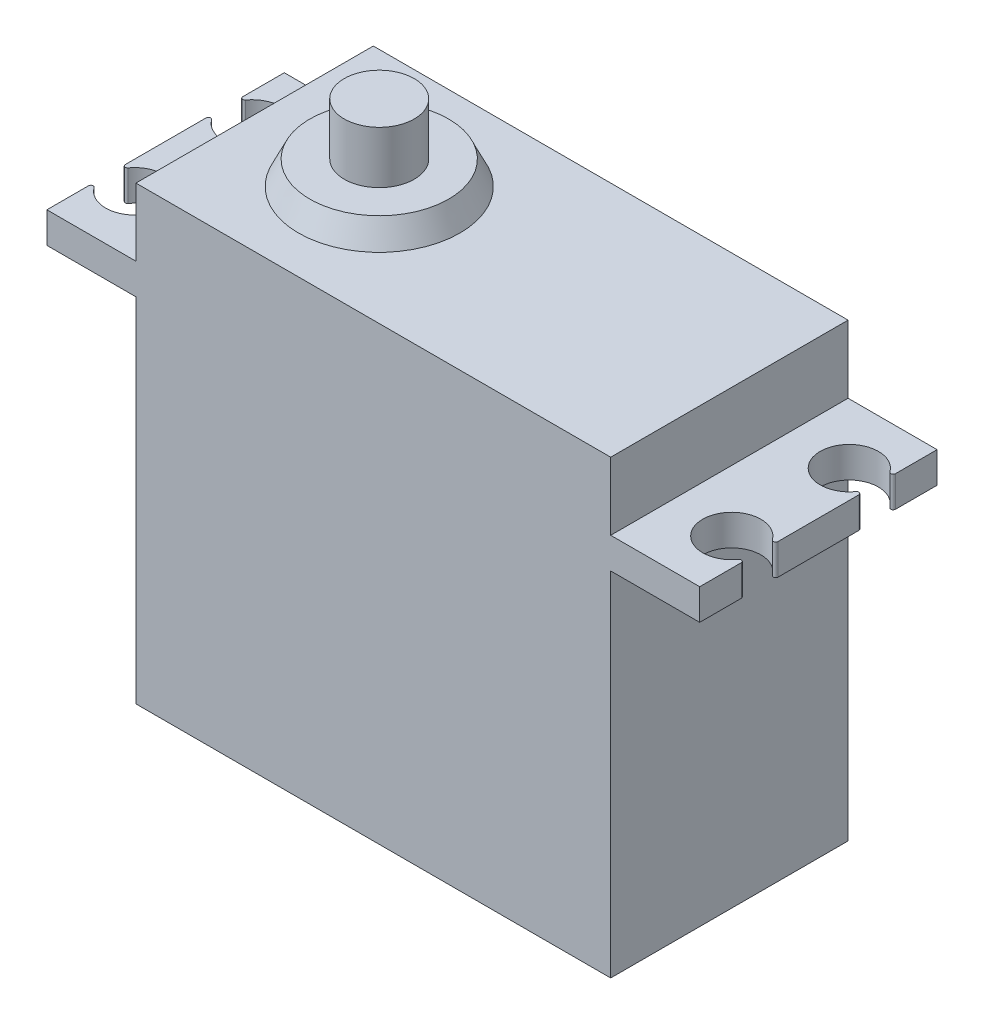
ISO-10303-21;
HEADER;
FILE_DESCRIPTION(('STEP AP214'),'2;1');
FILE_NAME('part.step','',(''),(''),'','','');
FILE_SCHEMA(('AUTOMOTIVE_DESIGN { 1 0 10303 214 1 1 1 1 }'));
ENDSEC;
DATA;
#1=APPLICATION_CONTEXT('core data for automotive mechanical design processes');
#2=APPLICATION_PROTOCOL_DEFINITION('international standard','automotive_design',2000,#1);
#3=PRODUCT_CONTEXT('',#1,'mechanical');
#4=PRODUCT('Part','Part','',(#3));
#5=PRODUCT_RELATED_PRODUCT_CATEGORY('part','',(#4));
#6=PRODUCT_DEFINITION_FORMATION('','',#4);
#7=PRODUCT_DEFINITION_CONTEXT('part definition',#1,'design');
#8=PRODUCT_DEFINITION('design','',#6,#7);
#9=PRODUCT_DEFINITION_SHAPE('','',#8);
#10=(LENGTH_UNIT() NAMED_UNIT(*) SI_UNIT(.MILLI.,.METRE.));
#11=(NAMED_UNIT(*) PLANE_ANGLE_UNIT() SI_UNIT($,.RADIAN.));
#12=(NAMED_UNIT(*) SI_UNIT($,.STERADIAN.) SOLID_ANGLE_UNIT());
#13=UNCERTAINTY_MEASURE_WITH_UNIT(LENGTH_MEASURE(1.E-05),#10,'distance_accuracy_value','');
#14=(GEOMETRIC_REPRESENTATION_CONTEXT(3) GLOBAL_UNCERTAINTY_ASSIGNED_CONTEXT((#13)) GLOBAL_UNIT_ASSIGNED_CONTEXT((#10,
#11,#12)) REPRESENTATION_CONTEXT('',''));
#15=CARTESIAN_POINT('',(0.,0.,0.));
#16=DIRECTION('',(0.,0.,1.));
#17=DIRECTION('',(1.,0.,0.));
#18=AXIS2_PLACEMENT_3D('',#15,#16,#17);
#19=CARTESIAN_POINT('',(-18.,0.,10.));
#20=DIRECTION('',(-1.,0.,0.));
#21=DIRECTION('',(0.,0.,1.));
#22=AXIS2_PLACEMENT_3D('',#19,#20,#21);
#23=PLANE('',#22);
#24=DIRECTION('',(0.,0.,-1.));
#25=VECTOR('',#24,1.);
#26=CARTESIAN_POINT('',(-18.,-5.70000000000001,10.));
#27=LINE('',#26,#25);
#28=CARTESIAN_POINT('',(-18.,-5.70000000000001,10.));
#29=VERTEX_POINT('',#28);
#30=CARTESIAN_POINT('',(-18.,-5.70000000000001,6.49919333848294));
#31=VERTEX_POINT('',#30);
#32=EDGE_CURVE('E327',#29,#31,#27,.T.);
#33=ORIENTED_EDGE('',*,*,#32,.T.);
#34=DIRECTION('',(0.,-1.,0.));
#35=VECTOR('',#34,1.);
#36=CARTESIAN_POINT('',(-18.,-8.30000000000001,6.49919333848294));
#37=LINE('',#36,#35);
#38=CARTESIAN_POINT('',(-18.,-8.30000000000001,6.49919333848294));
#39=VERTEX_POINT('',#38);
#40=EDGE_CURVE('E406',#31,#39,#37,.T.);
#41=ORIENTED_EDGE('',*,*,#40,.T.);
#42=DIRECTION('',(0.,0.,-1.));
#43=VECTOR('',#42,1.);
#44=CARTESIAN_POINT('',(-18.,-8.30000000000001,10.));
#45=LINE('',#44,#43);
#46=CARTESIAN_POINT('',(-18.,-8.30000000000001,10.));
#47=VERTEX_POINT('',#46);
#48=EDGE_CURVE('E322',#47,#39,#45,.T.);
#49=ORIENTED_EDGE('',*,*,#48,.F.);
#50=DIRECTION('',(0.,1.,0.));
#51=VECTOR('',#50,1.);
#52=CARTESIAN_POINT('',(-18.,0.,10.));
#53=LINE('',#52,#51);
#54=EDGE_CURVE('E259',#47,#29,#53,.T.);
#55=ORIENTED_EDGE('',*,*,#54,.T.);
#56=EDGE_LOOP('',(#33,#41,#49,#55));
#57=FACE_BOUND('',#56,.T.);
#58=ADVANCED_FACE('F39',(#57),#23,.T.);
#59=CARTESIAN_POINT('',(-18.,-8.30000000000001,3.40080666151706));
#60=VERTEX_POINT('',#59);
#61=CARTESIAN_POINT('',(-18.,-8.30000000000001,-3.40080666151706));
#62=VERTEX_POINT('',#61);
#63=EDGE_CURVE('E326',#60,#62,#45,.T.);
#64=ORIENTED_EDGE('',*,*,#63,.F.);
#65=DIRECTION('',(0.,-1.,0.));
#66=VECTOR('',#65,1.);
#67=CARTESIAN_POINT('',(-18.,-5.7,3.40080666151706));
#68=LINE('',#67,#66);
#69=CARTESIAN_POINT('',(-18.,-5.70000000000001,3.40080666151706));
#70=VERTEX_POINT('',#69);
#71=EDGE_CURVE('E398',#60,#70,#68,.F.);
#72=ORIENTED_EDGE('',*,*,#71,.T.);
#73=CARTESIAN_POINT('',(-18.,-5.70000000000001,-3.40080666151706));
#74=VERTEX_POINT('',#73);
#75=EDGE_CURVE('E331',#70,#74,#27,.T.);
#76=ORIENTED_EDGE('',*,*,#75,.T.);
#77=DIRECTION('',(0.,-1.,0.));
#78=VECTOR('',#77,1.);
#79=CARTESIAN_POINT('',(-18.,-8.30000000000001,-3.40080666151706));
#80=LINE('',#79,#78);
#81=EDGE_CURVE('E396',#74,#62,#80,.T.);
#82=ORIENTED_EDGE('',*,*,#81,.T.);
#83=EDGE_LOOP('',(#64,#72,#76,#82));
#84=FACE_BOUND('',#83,.T.);
#85=ADVANCED_FACE('F457',(#84),#23,.T.);
#86=CARTESIAN_POINT('',(37.,0.,10.));
#87=DIRECTION('',(-1.,0.,0.));
#88=DIRECTION('',(0.,0.,1.));
#89=AXIS2_PLACEMENT_3D('',#86,#87,#88);
#90=PLANE('',#89);
#91=DIRECTION('',(0.,0.,-1.));
#92=VECTOR('',#91,1.);
#93=CARTESIAN_POINT('',(37.,-8.29999999999998,10.));
#94=LINE('',#93,#92);
#95=CARTESIAN_POINT('',(37.,-8.29999999999998,3.40080666151698));
#96=VERTEX_POINT('',#95);
#97=CARTESIAN_POINT('',(37.,-8.29999999999998,-3.400806661517));
#98=VERTEX_POINT('',#97);
#99=EDGE_CURVE('E312',#96,#98,#94,.T.);
#100=ORIENTED_EDGE('',*,*,#99,.T.);
#101=DIRECTION('',(0.,1.,0.));
#102=VECTOR('',#101,1.);
#103=CARTESIAN_POINT('',(37.,0.,-3.400806661517));
#104=LINE('',#103,#102);
#105=CARTESIAN_POINT('',(37.,-5.69999999999999,-3.400806661517));
#106=VERTEX_POINT('',#105);
#107=EDGE_CURVE('E372',#98,#106,#104,.T.);
#108=ORIENTED_EDGE('',*,*,#107,.T.);
#109=DIRECTION('',(0.,0.,-1.));
#110=VECTOR('',#109,1.);
#111=CARTESIAN_POINT('',(37.,-5.69999999999999,10.));
#112=LINE('',#111,#110);
#113=CARTESIAN_POINT('',(37.,-5.69999999999999,3.40080666151698));
#114=VERTEX_POINT('',#113);
#115=EDGE_CURVE('E307',#114,#106,#112,.T.);
#116=ORIENTED_EDGE('',*,*,#115,.F.);
#117=DIRECTION('',(0.,1.,0.));
#118=VECTOR('',#117,1.);
#119=CARTESIAN_POINT('',(37.,0.,3.40080666151698));
#120=LINE('',#119,#118);
#121=EDGE_CURVE('E369',#114,#96,#120,.F.);
#122=ORIENTED_EDGE('',*,*,#121,.T.);
#123=EDGE_LOOP('',(#100,#108,#116,#122));
#124=FACE_BOUND('',#123,.T.);
#125=ADVANCED_FACE('F464',(#124),#90,.F.);
#126=CARTESIAN_POINT('',(37.,-8.29999999999998,10.));
#127=VERTEX_POINT('',#126);
#128=CARTESIAN_POINT('',(37.,-8.29999999999998,6.49919333848301));
#129=VERTEX_POINT('',#128);
#130=EDGE_CURVE('E308',#127,#129,#94,.T.);
#131=ORIENTED_EDGE('',*,*,#130,.T.);
#132=DIRECTION('',(0.,1.,0.));
#133=VECTOR('',#132,1.);
#134=CARTESIAN_POINT('',(37.,0.,6.49919333848301));
#135=LINE('',#134,#133);
#136=CARTESIAN_POINT('',(37.,-5.69999999999999,6.49919333848301));
#137=VERTEX_POINT('',#136);
#138=EDGE_CURVE('E346',#129,#137,#135,.T.);
#139=ORIENTED_EDGE('',*,*,#138,.T.);
#140=CARTESIAN_POINT('',(37.,-5.69999999999999,10.));
#141=VERTEX_POINT('',#140);
#142=EDGE_CURVE('E303',#141,#137,#112,.T.);
#143=ORIENTED_EDGE('',*,*,#142,.F.);
#144=DIRECTION('',(0.,1.,0.));
#145=VECTOR('',#144,1.);
#146=CARTESIAN_POINT('',(37.,0.,10.));
#147=LINE('',#146,#145);
#148=EDGE_CURVE('E269',#127,#141,#147,.T.);
#149=ORIENTED_EDGE('',*,*,#148,.F.);
#150=EDGE_LOOP('',(#131,#139,#143,#149));
#151=FACE_BOUND('',#150,.T.);
#152=ADVANCED_FACE('F643',(#151),#90,.F.);
#153=CARTESIAN_POINT('',(29.5,0.,10.));
#154=DIRECTION('',(1.,0.,0.));
#155=DIRECTION('',(0.,1.,0.));
#156=AXIS2_PLACEMENT_3D('',#153,#154,#155);
#157=PLANE('',#156);
#158=DIRECTION('',(0.,-1.,0.));
#159=VECTOR('',#158,1.);
#160=CARTESIAN_POINT('',(29.5,0.,-10.));
#161=LINE('',#160,#159);
#162=CARTESIAN_POINT('',(29.5,0.,-10.));
#163=VERTEX_POINT('',#162);
#164=CARTESIAN_POINT('',(29.5,-5.69999999999999,-10.));
#165=VERTEX_POINT('',#164);
#166=EDGE_CURVE('E232',#163,#165,#161,.T.);
#167=ORIENTED_EDGE('',*,*,#166,.F.);
#168=DIRECTION('',(0.,0.,-1.));
#169=VECTOR('',#168,1.);
#170=CARTESIAN_POINT('',(29.5,0.,10.));
#171=LINE('',#170,#169);
#172=CARTESIAN_POINT('',(29.5,0.,10.));
#173=VERTEX_POINT('',#172);
#174=EDGE_CURVE('E226',#173,#163,#171,.T.);
#175=ORIENTED_EDGE('',*,*,#174,.F.);
#176=DIRECTION('',(0.,-1.,0.));
#177=VECTOR('',#176,1.);
#178=CARTESIAN_POINT('',(29.5,0.,10.));
#179=LINE('',#178,#177);
#180=CARTESIAN_POINT('',(29.5,-5.69999999999999,10.));
#181=VERTEX_POINT('',#180);
#182=EDGE_CURVE('E229',#173,#181,#179,.T.);
#183=ORIENTED_EDGE('',*,*,#182,.T.);
#184=DIRECTION('',(0.,0.,-1.));
#185=VECTOR('',#184,1.);
#186=CARTESIAN_POINT('',(29.5,-5.69999999999999,10.));
#187=LINE('',#186,#185);
#188=EDGE_CURVE('E272',#181,#165,#187,.T.);
#189=ORIENTED_EDGE('',*,*,#188,.T.);
#190=EDGE_LOOP('',(#167,#175,#183,#189));
#191=FACE_BOUND('',#190,.T.);
#192=ADVANCED_FACE('F228',(#191),#157,.T.);
#193=CARTESIAN_POINT('',(0.,0.,10.));
#194=DIRECTION('',(0.,1.,0.));
#195=DIRECTION('',(0.,0.,1.));
#196=AXIS2_PLACEMENT_3D('',#193,#194,#195);
#197=PLANE('',#196);
#198=CARTESIAN_POINT('',(0.,0.,0.));
#199=DIRECTION('',(0.,1.,0.));
#200=DIRECTION('',(0.,0.,1.));
#201=AXIS2_PLACEMENT_3D('',#198,#199,#200);
#202=CIRCLE('',#201,6.8);
#203=CARTESIAN_POINT('',(0.,0.,6.8));
#204=VERTEX_POINT('',#203);
#205=EDGE_CURVE('E237',#204,#204,#202,.T.);
#206=ORIENTED_EDGE('',*,*,#205,.F.);
#207=EDGE_LOOP('',(#206));
#208=FACE_BOUND('',#207,.T.);
#209=DIRECTION('',(1.,0.,0.));
#210=VECTOR('',#209,1.);
#211=CARTESIAN_POINT('',(0.,0.,-10.));
#212=LINE('',#211,#210);
#213=CARTESIAN_POINT('',(-10.5,0.,-10.));
#214=VERTEX_POINT('',#213);
#215=EDGE_CURVE('E274',#214,#163,#212,.T.);
#216=ORIENTED_EDGE('',*,*,#215,.F.);
#217=DIRECTION('',(0.,0.,-1.));
#218=VECTOR('',#217,1.);
#219=CARTESIAN_POINT('',(-10.5,0.,10.));
#220=LINE('',#219,#218);
#221=CARTESIAN_POINT('',(-10.5,0.,10.));
#222=VERTEX_POINT('',#221);
#223=EDGE_CURVE('E238',#222,#214,#220,.T.);
#224=ORIENTED_EDGE('',*,*,#223,.F.);
#225=DIRECTION('',(1.,0.,0.));
#226=VECTOR('',#225,1.);
#227=CARTESIAN_POINT('',(0.,0.,10.));
#228=LINE('',#227,#226);
#229=EDGE_CURVE('E243',#222,#173,#228,.T.);
#230=ORIENTED_EDGE('',*,*,#229,.T.);
#231=ORIENTED_EDGE('',*,*,#174,.T.);
#232=EDGE_LOOP('',(#216,#224,#230,#231));
#233=FACE_BOUND('',#232,.T.);
#234=ADVANCED_FACE('F249',(#208,#233),#197,.T.);
#235=CARTESIAN_POINT('',(-10.5,0.,10.));
#236=DIRECTION('',(1.,0.,0.));
#237=DIRECTION('',(0.,1.,0.));
#238=AXIS2_PLACEMENT_3D('',#235,#236,#237);
#239=PLANE('',#238);
#240=DIRECTION('',(0.,-1.,0.));
#241=VECTOR('',#240,1.);
#242=CARTESIAN_POINT('',(-10.5,0.,-10.));
#243=LINE('',#242,#241);
#244=CARTESIAN_POINT('',(-10.5,-5.7,-10.));
#245=VERTEX_POINT('',#244);
#246=EDGE_CURVE('E278',#214,#245,#243,.T.);
#247=ORIENTED_EDGE('',*,*,#246,.T.);
#248=DIRECTION('',(0.,0.,-1.));
#249=VECTOR('',#248,1.);
#250=CARTESIAN_POINT('',(-10.5,-5.7,10.));
#251=LINE('',#250,#249);
#252=CARTESIAN_POINT('',(-10.5,-5.7,10.));
#253=VERTEX_POINT('',#252);
#254=EDGE_CURVE('E330',#253,#245,#251,.T.);
#255=ORIENTED_EDGE('',*,*,#254,.F.);
#256=DIRECTION('',(0.,-1.,0.));
#257=VECTOR('',#256,1.);
#258=CARTESIAN_POINT('',(-10.5,0.,10.));
#259=LINE('',#258,#257);
#260=EDGE_CURVE('E251',#222,#253,#259,.T.);
#261=ORIENTED_EDGE('',*,*,#260,.F.);
#262=ORIENTED_EDGE('',*,*,#223,.T.);
#263=EDGE_LOOP('',(#247,#255,#261,#262));
#264=FACE_BOUND('',#263,.T.);
#265=ADVANCED_FACE('F477',(#264),#239,.F.);
#266=CARTESIAN_POINT('',(0.,-5.69999999999999,10.));
#267=DIRECTION('',(0.,-1.,0.));
#268=DIRECTION('',(1.,0.,0.));
#269=AXIS2_PLACEMENT_3D('',#266,#267,#268);
#270=PLANE('',#269);
#271=ORIENTED_EDGE('',*,*,#75,.F.);
#272=CARTESIAN_POINT('',(-17.8,-5.7,3.40080666151706));
#273=DIRECTION('',(0.,-1.,0.));
#274=DIRECTION('',(1.,0.,0.));
#275=AXIS2_PLACEMENT_3D('',#272,#273,#274);
#276=CIRCLE('',#275,0.2);
#277=CARTESIAN_POINT('',(-17.6377358490566,-5.70000000000001,3.51772691347804));
#278=VERTEX_POINT('',#277);
#279=EDGE_CURVE('E404',#70,#278,#276,.F.);
#280=ORIENTED_EDGE('',*,*,#279,.T.);
#281=CARTESIAN_POINT('',(-15.65,-5.7,4.95));
#282=DIRECTION('',(0.,1.,0.));
#283=DIRECTION('',(1.,0.,0.));
#284=AXIS2_PLACEMENT_3D('',#281,#282,#283);
#285=CIRCLE('',#284,2.45);
#286=CARTESIAN_POINT('',(-17.6377358490566,-5.70000000000001,6.38227308652197));
#287=VERTEX_POINT('',#286);
#288=EDGE_CURVE('E420',#287,#278,#285,.T.);
#289=ORIENTED_EDGE('',*,*,#288,.F.);
#290=CARTESIAN_POINT('',(-17.8,-5.7,6.49919333848294));
#291=DIRECTION('',(0.,-1.,0.));
#292=DIRECTION('',(1.,0.,0.));
#293=AXIS2_PLACEMENT_3D('',#290,#291,#292);
#294=CIRCLE('',#293,0.2);
#295=EDGE_CURVE('E402',#287,#31,#294,.F.);
#296=ORIENTED_EDGE('',*,*,#295,.T.);
#297=ORIENTED_EDGE('',*,*,#32,.F.);
#298=DIRECTION('',(-1.,0.,0.));
#299=VECTOR('',#298,1.);
#300=CARTESIAN_POINT('',(0.,-5.69999999999999,10.));
#301=LINE('',#300,#299);
#302=EDGE_CURVE('E253',#253,#29,#301,.T.);
#303=ORIENTED_EDGE('',*,*,#302,.F.);
#304=ORIENTED_EDGE('',*,*,#254,.T.);
#305=DIRECTION('',(-1.,0.,0.));
#306=VECTOR('',#305,1.);
#307=CARTESIAN_POINT('',(0.,-5.69999999999999,-10.));
#308=LINE('',#307,#306);
#309=CARTESIAN_POINT('',(-18.,-5.70000000000001,-10.));
#310=VERTEX_POINT('',#309);
#311=EDGE_CURVE('E280',#245,#310,#308,.T.);
#312=ORIENTED_EDGE('',*,*,#311,.T.);
#313=CARTESIAN_POINT('',(-18.,-5.70000000000001,-6.49919333848294));
#314=VERTEX_POINT('',#313);
#315=EDGE_CURVE('E325',#314,#310,#27,.T.);
#316=ORIENTED_EDGE('',*,*,#315,.F.);
#317=CARTESIAN_POINT('',(-17.8,-5.7,-6.49919333848294));
#318=DIRECTION('',(0.,-1.,0.));
#319=DIRECTION('',(1.,0.,0.));
#320=AXIS2_PLACEMENT_3D('',#317,#318,#319);
#321=CIRCLE('',#320,0.2);
#322=CARTESIAN_POINT('',(-17.6377358490566,-5.70000000000001,-6.38227308652197));
#323=VERTEX_POINT('',#322);
#324=EDGE_CURVE('E54',#314,#323,#321,.F.);
#325=ORIENTED_EDGE('',*,*,#324,.T.);
#326=CARTESIAN_POINT('',(-15.65,-5.7,-4.95));
#327=DIRECTION('',(0.,1.,0.));
#328=DIRECTION('',(-1.,0.,0.));
#329=AXIS2_PLACEMENT_3D('',#326,#327,#328);
#330=CIRCLE('',#329,2.45);
#331=CARTESIAN_POINT('',(-17.6377358490566,-5.70000000000001,-3.51772691347804));
#332=VERTEX_POINT('',#331);
#333=EDGE_CURVE('E412',#332,#323,#330,.T.);
#334=ORIENTED_EDGE('',*,*,#333,.F.);
#335=CARTESIAN_POINT('',(-17.8,-5.7,-3.40080666151706));
#336=DIRECTION('',(0.,-1.,0.));
#337=DIRECTION('',(1.,0.,0.));
#338=AXIS2_PLACEMENT_3D('',#335,#336,#337);
#339=CIRCLE('',#338,0.2);
#340=EDGE_CURVE('E62',#332,#74,#339,.F.);
#341=ORIENTED_EDGE('',*,*,#340,.T.);
#342=EDGE_LOOP('',(#271,#280,#289,#296,#297,#303,#304,#312,#316,#325,#334,#341));
#343=FACE_BOUND('',#342,.T.);
#344=ADVANCED_FACE('F417',(#343),#270,.F.);
#345=CARTESIAN_POINT('',(-18.,-8.30000000000001,-6.49919333848294));
#346=VERTEX_POINT('',#345);
#347=CARTESIAN_POINT('',(-18.,-8.30000000000001,-10.));
#348=VERTEX_POINT('',#347);
#349=EDGE_CURVE('E321',#346,#348,#45,.T.);
#350=ORIENTED_EDGE('',*,*,#349,.F.);
#351=DIRECTION('',(0.,-1.,0.));
#352=VECTOR('',#351,1.);
#353=CARTESIAN_POINT('',(-18.,-5.7,-6.49919333848294));
#354=LINE('',#353,#352);
#355=EDGE_CURVE('E11',#346,#314,#354,.F.);
#356=ORIENTED_EDGE('',*,*,#355,.T.);
#357=ORIENTED_EDGE('',*,*,#315,.T.);
#358=DIRECTION('',(0.,1.,0.));
#359=VECTOR('',#358,1.);
#360=CARTESIAN_POINT('',(-18.,0.,-10.));
#361=LINE('',#360,#359);
#362=EDGE_CURVE('E284',#348,#310,#361,.T.);
#363=ORIENTED_EDGE('',*,*,#362,.F.);
#364=EDGE_LOOP('',(#350,#356,#357,#363));
#365=FACE_BOUND('',#364,.T.);
#366=ADVANCED_FACE('F460',(#365),#23,.T.);
#367=CARTESIAN_POINT('',(0.,-8.30000000000001,10.));
#368=DIRECTION('',(0.,-1.,0.));
#369=DIRECTION('',(1.,0.,0.));
#370=AXIS2_PLACEMENT_3D('',#367,#368,#369);
#371=PLANE('',#370);
#372=CARTESIAN_POINT('',(-15.65,-8.30000000000001,4.95));
#373=DIRECTION('',(0.,-1.,0.));
#374=DIRECTION('',(1.,0.,0.));
#375=AXIS2_PLACEMENT_3D('',#372,#373,#374);
#376=CIRCLE('',#375,2.45);
#377=CARTESIAN_POINT('',(-17.6377358490566,-8.30000000000001,3.51772691347803));
#378=VERTEX_POINT('',#377);
#379=CARTESIAN_POINT('',(-17.6377358490566,-8.30000000000001,6.38227308652197));
#380=VERTEX_POINT('',#379);
#381=EDGE_CURVE('E343',#378,#380,#376,.T.);
#382=ORIENTED_EDGE('',*,*,#381,.F.);
#383=CARTESIAN_POINT('',(-17.8,-8.30000000000001,3.40080666151706));
#384=DIRECTION('',(0.,-1.,0.));
#385=DIRECTION('',(1.,0.,0.));
#386=AXIS2_PLACEMENT_3D('',#383,#384,#385);
#387=CIRCLE('',#386,0.2);
#388=EDGE_CURVE('E394',#378,#60,#387,.T.);
#389=ORIENTED_EDGE('',*,*,#388,.T.);
#390=ORIENTED_EDGE('',*,*,#63,.T.);
#391=CARTESIAN_POINT('',(-17.8,-8.30000000000001,-3.40080666151706));
#392=DIRECTION('',(0.,-1.,0.));
#393=DIRECTION('',(1.,0.,0.));
#394=AXIS2_PLACEMENT_3D('',#391,#392,#393);
#395=CIRCLE('',#394,0.2);
#396=CARTESIAN_POINT('',(-17.6377358490566,-8.30000000000001,-3.51772691347803));
#397=VERTEX_POINT('',#396);
#398=EDGE_CURVE('E390',#62,#397,#395,.T.);
#399=ORIENTED_EDGE('',*,*,#398,.T.);
#400=CARTESIAN_POINT('',(-15.65,-8.30000000000001,-4.95));
#401=DIRECTION('',(0.,-1.,0.));
#402=DIRECTION('',(1.,0.,0.));
#403=AXIS2_PLACEMENT_3D('',#400,#401,#402);
#404=CIRCLE('',#403,2.45);
#405=CARTESIAN_POINT('',(-17.6377358490566,-8.30000000000001,-6.38227308652197));
#406=VERTEX_POINT('',#405);
#407=EDGE_CURVE('E340',#406,#397,#404,.T.);
#408=ORIENTED_EDGE('',*,*,#407,.F.);
#409=CARTESIAN_POINT('',(-17.8,-8.30000000000001,-6.49919333848294));
#410=DIRECTION('',(0.,-1.,0.));
#411=DIRECTION('',(1.,0.,0.));
#412=AXIS2_PLACEMENT_3D('',#409,#410,#411);
#413=CIRCLE('',#412,0.2);
#414=EDGE_CURVE('E388',#406,#346,#413,.T.);
#415=ORIENTED_EDGE('',*,*,#414,.T.);
#416=ORIENTED_EDGE('',*,*,#349,.T.);
#417=DIRECTION('',(-1.,0.,0.));
#418=VECTOR('',#417,1.);
#419=CARTESIAN_POINT('',(0.,-8.30000000000001,-10.));
#420=LINE('',#419,#418);
#421=CARTESIAN_POINT('',(-10.5,-8.30000000000001,-10.));
#422=VERTEX_POINT('',#421);
#423=EDGE_CURVE('E287',#422,#348,#420,.T.);
#424=ORIENTED_EDGE('',*,*,#423,.F.);
#425=DIRECTION('',(0.,0.,-1.));
#426=VECTOR('',#425,1.);
#427=CARTESIAN_POINT('',(-10.5,-8.30000000000001,10.));
#428=LINE('',#427,#426);
#429=CARTESIAN_POINT('',(-10.5,-8.30000000000001,10.));
#430=VERTEX_POINT('',#429);
#431=EDGE_CURVE('E319',#430,#422,#428,.T.);
#432=ORIENTED_EDGE('',*,*,#431,.F.);
#433=DIRECTION('',(-1.,0.,0.));
#434=VECTOR('',#433,1.);
#435=CARTESIAN_POINT('',(0.,-8.30000000000001,10.));
#436=LINE('',#435,#434);
#437=EDGE_CURVE('E262',#430,#47,#436,.T.);
#438=ORIENTED_EDGE('',*,*,#437,.T.);
#439=ORIENTED_EDGE('',*,*,#48,.T.);
#440=CARTESIAN_POINT('',(-17.8,-8.30000000000001,6.49919333848294));
#441=DIRECTION('',(0.,-1.,0.));
#442=DIRECTION('',(1.,0.,0.));
#443=AXIS2_PLACEMENT_3D('',#440,#441,#442);
#444=CIRCLE('',#443,0.2);
#445=EDGE_CURVE('E392',#39,#380,#444,.T.);
#446=ORIENTED_EDGE('',*,*,#445,.T.);
#447=EDGE_LOOP('',(#382,#389,#390,#399,#408,#415,#416,#424,#432,#438,#439,#446));
#448=FACE_BOUND('',#447,.T.);
#449=ADVANCED_FACE('F469',(#448),#371,.T.);
#450=CARTESIAN_POINT('',(-10.5,-38.,-10.));
#451=VERTEX_POINT('',#450);
#452=EDGE_CURVE('E281',#422,#451,#243,.T.);
#453=ORIENTED_EDGE('',*,*,#452,.T.);
#454=DIRECTION('',(0.,0.,-1.));
#455=VECTOR('',#454,1.);
#456=CARTESIAN_POINT('',(-10.5,-38.,10.));
#457=LINE('',#456,#455);
#458=CARTESIAN_POINT('',(-10.5,-38.,10.));
#459=VERTEX_POINT('',#458);
#460=EDGE_CURVE('E316',#459,#451,#457,.T.);
#461=ORIENTED_EDGE('',*,*,#460,.F.);
#462=EDGE_CURVE('E255',#430,#459,#259,.T.);
#463=ORIENTED_EDGE('',*,*,#462,.F.);
#464=ORIENTED_EDGE('',*,*,#431,.T.);
#465=EDGE_LOOP('',(#453,#461,#463,#464));
#466=FACE_BOUND('',#465,.T.);
#467=ADVANCED_FACE('F475',(#466),#239,.F.);
#468=CARTESIAN_POINT('',(0.,-38.,10.));
#469=DIRECTION('',(0.,1.,0.));
#470=DIRECTION('',(0.,0.,1.));
#471=AXIS2_PLACEMENT_3D('',#468,#469,#470);
#472=PLANE('',#471);
#473=DIRECTION('',(1.,0.,0.));
#474=VECTOR('',#473,1.);
#475=CARTESIAN_POINT('',(0.,-38.,-10.));
#476=LINE('',#475,#474);
#477=CARTESIAN_POINT('',(29.5,-38.,-10.));
#478=VERTEX_POINT('',#477);
#479=EDGE_CURVE('E290',#451,#478,#476,.T.);
#480=ORIENTED_EDGE('',*,*,#479,.T.);
#481=DIRECTION('',(0.,0.,-1.));
#482=VECTOR('',#481,1.);
#483=CARTESIAN_POINT('',(29.5,-38.,10.));
#484=LINE('',#483,#482);
#485=CARTESIAN_POINT('',(29.5,-38.,10.));
#486=VERTEX_POINT('',#485);
#487=EDGE_CURVE('E314',#486,#478,#484,.T.);
#488=ORIENTED_EDGE('',*,*,#487,.F.);
#489=DIRECTION('',(1.,0.,0.));
#490=VECTOR('',#489,1.);
#491=CARTESIAN_POINT('',(0.,-38.,10.));
#492=LINE('',#491,#490);
#493=EDGE_CURVE('E265',#459,#486,#492,.T.);
#494=ORIENTED_EDGE('',*,*,#493,.F.);
#495=ORIENTED_EDGE('',*,*,#460,.T.);
#496=EDGE_LOOP('',(#480,#488,#494,#495));
#497=FACE_BOUND('',#496,.T.);
#498=ADVANCED_FACE('F761',(#497),#472,.F.);
#499=CARTESIAN_POINT('',(29.5,-8.29999999999998,-10.));
#500=VERTEX_POINT('',#499);
#501=EDGE_CURVE('E276',#500,#478,#161,.T.);
#502=ORIENTED_EDGE('',*,*,#501,.F.);
#503=DIRECTION('',(0.,0.,-1.));
#504=VECTOR('',#503,1.);
#505=CARTESIAN_POINT('',(29.5,-8.29999999999998,10.));
#506=LINE('',#505,#504);
#507=CARTESIAN_POINT('',(29.5,-8.29999999999998,10.));
#508=VERTEX_POINT('',#507);
#509=EDGE_CURVE('E311',#508,#500,#506,.T.);
#510=ORIENTED_EDGE('',*,*,#509,.F.);
#511=EDGE_CURVE('E248',#508,#486,#179,.T.);
#512=ORIENTED_EDGE('',*,*,#511,.T.);
#513=ORIENTED_EDGE('',*,*,#487,.T.);
#514=EDGE_LOOP('',(#502,#510,#512,#513));
#515=FACE_BOUND('',#514,.T.);
#516=ADVANCED_FACE('F651',(#515),#157,.T.);
#517=CARTESIAN_POINT('',(0.,-8.30000000000001,10.));
#518=DIRECTION('',(0.,1.,0.));
#519=DIRECTION('',(-1.,0.,0.));
#520=AXIS2_PLACEMENT_3D('',#517,#518,#519);
#521=PLANE('',#520);
#522=CARTESIAN_POINT('',(34.65,-8.29999999999998,4.94999999999999));
#523=DIRECTION('',(0.,1.,0.));
#524=DIRECTION('',(-1.,0.,0.));
#525=AXIS2_PLACEMENT_3D('',#522,#523,#524);
#526=CIRCLE('',#525,2.45);
#527=CARTESIAN_POINT('',(36.6377358490566,-8.29999999999998,3.51772691347797));
#528=VERTEX_POINT('',#527);
#529=CARTESIAN_POINT('',(36.6377358490566,-8.29999999999998,6.38227308652202));
#530=VERTEX_POINT('',#529);
#531=EDGE_CURVE('E419',#528,#530,#526,.T.);
#532=ORIENTED_EDGE('',*,*,#531,.T.);
#533=CARTESIAN_POINT('',(36.8,-8.29999999999998,6.49919333848301));
#534=DIRECTION('',(0.,1.,0.));
#535=DIRECTION('',(-1.,0.,0.));
#536=AXIS2_PLACEMENT_3D('',#533,#534,#535);
#537=CIRCLE('',#536,0.2);
#538=EDGE_CURVE('E367',#530,#129,#537,.F.);
#539=ORIENTED_EDGE('',*,*,#538,.T.);
#540=ORIENTED_EDGE('',*,*,#130,.F.);
#541=DIRECTION('',(1.,0.,0.));
#542=VECTOR('',#541,1.);
#543=CARTESIAN_POINT('',(0.,-8.30000000000001,10.));
#544=LINE('',#543,#542);
#545=EDGE_CURVE('E267',#508,#127,#544,.T.);
#546=ORIENTED_EDGE('',*,*,#545,.F.);
#547=ORIENTED_EDGE('',*,*,#509,.T.);
#548=DIRECTION('',(1.,0.,0.));
#549=VECTOR('',#548,1.);
#550=CARTESIAN_POINT('',(0.,-8.30000000000001,-10.));
#551=LINE('',#550,#549);
#552=CARTESIAN_POINT('',(37.,-8.29999999999998,-10.));
#553=VERTEX_POINT('',#552);
#554=EDGE_CURVE('E293',#500,#553,#551,.T.);
#555=ORIENTED_EDGE('',*,*,#554,.T.);
#556=CARTESIAN_POINT('',(37.,-8.29999999999998,-6.49919333848301));
#557=VERTEX_POINT('',#556);
#558=EDGE_CURVE('E306',#557,#553,#94,.T.);
#559=ORIENTED_EDGE('',*,*,#558,.F.);
#560=CARTESIAN_POINT('',(36.8,-8.29999999999998,-6.49919333848301));
#561=DIRECTION('',(0.,1.,0.));
#562=DIRECTION('',(-1.,0.,0.));
#563=AXIS2_PLACEMENT_3D('',#560,#561,#562);
#564=CIRCLE('',#563,0.2);
#565=CARTESIAN_POINT('',(36.6377358490566,-8.29999999999998,-6.38227308652203));
#566=VERTEX_POINT('',#565);
#567=EDGE_CURVE('E361',#557,#566,#564,.F.);
#568=ORIENTED_EDGE('',*,*,#567,.T.);
#569=CARTESIAN_POINT('',(34.65,-8.29999999999998,-4.95000000000001));
#570=DIRECTION('',(0.,1.,0.));
#571=DIRECTION('',(-1.,0.,0.));
#572=AXIS2_PLACEMENT_3D('',#569,#570,#571);
#573=CIRCLE('',#572,2.45);
#574=CARTESIAN_POINT('',(36.6377358490566,-8.29999999999998,-3.51772691347799));
#575=VERTEX_POINT('',#574);
#576=EDGE_CURVE('E423',#566,#575,#573,.T.);
#577=ORIENTED_EDGE('',*,*,#576,.T.);
#578=CARTESIAN_POINT('',(36.8,-8.29999999999998,-3.400806661517));
#579=DIRECTION('',(0.,1.,0.));
#580=DIRECTION('',(-1.,0.,0.));
#581=AXIS2_PLACEMENT_3D('',#578,#579,#580);
#582=CIRCLE('',#581,0.2);
#583=EDGE_CURVE('E365',#575,#98,#582,.F.);
#584=ORIENTED_EDGE('',*,*,#583,.T.);
#585=ORIENTED_EDGE('',*,*,#99,.F.);
#586=CARTESIAN_POINT('',(36.8,-8.29999999999998,3.40080666151698));
#587=DIRECTION('',(0.,1.,0.));
#588=DIRECTION('',(-1.,0.,0.));
#589=AXIS2_PLACEMENT_3D('',#586,#587,#588);
#590=CIRCLE('',#589,0.2);
#591=EDGE_CURVE('E363',#96,#528,#590,.F.);
#592=ORIENTED_EDGE('',*,*,#591,.T.);
#593=EDGE_LOOP('',(#532,#539,#540,#546,#547,#555,#559,#568,#577,#584,#585,#592));
#594=FACE_BOUND('',#593,.T.);
#595=ADVANCED_FACE('F640',(#594),#521,.F.);
#596=CARTESIAN_POINT('',(37.,-5.69999999999999,-6.49919333848301));
#597=VERTEX_POINT('',#596);
#598=CARTESIAN_POINT('',(37.,-5.69999999999999,-10.));
#599=VERTEX_POINT('',#598);
#600=EDGE_CURVE('E302',#597,#599,#112,.T.);
#601=ORIENTED_EDGE('',*,*,#600,.F.);
#602=DIRECTION('',(0.,1.,0.));
#603=VECTOR('',#602,1.);
#604=CARTESIAN_POINT('',(37.,0.,-6.49919333848301));
#605=LINE('',#604,#603);
#606=EDGE_CURVE('E379',#597,#557,#605,.F.);
#607=ORIENTED_EDGE('',*,*,#606,.T.);
#608=ORIENTED_EDGE('',*,*,#558,.T.);
#609=DIRECTION('',(0.,1.,0.));
#610=VECTOR('',#609,1.);
#611=CARTESIAN_POINT('',(37.,0.,-10.));
#612=LINE('',#611,#610);
#613=EDGE_CURVE('E296',#553,#599,#612,.T.);
#614=ORIENTED_EDGE('',*,*,#613,.T.);
#615=EDGE_LOOP('',(#601,#607,#608,#614));
#616=FACE_BOUND('',#615,.T.);
#617=ADVANCED_FACE('F628',(#616),#90,.F.);
#618=CARTESIAN_POINT('',(0.,-5.69999999999999,10.));
#619=DIRECTION('',(0.,1.,0.));
#620=DIRECTION('',(-1.,0.,0.));
#621=AXIS2_PLACEMENT_3D('',#618,#619,#620);
#622=PLANE('',#621);
#623=ORIENTED_EDGE('',*,*,#142,.T.);
#624=CARTESIAN_POINT('',(36.8,-5.69999999999999,6.49919333848301));
#625=DIRECTION('',(0.,1.,0.));
#626=DIRECTION('',(-1.,0.,0.));
#627=AXIS2_PLACEMENT_3D('',#624,#625,#626);
#628=CIRCLE('',#627,0.2);
#629=CARTESIAN_POINT('',(36.6377358490566,-5.69999999999999,6.38227308652202));
#630=VERTEX_POINT('',#629);
#631=EDGE_CURVE('E355',#137,#630,#628,.T.);
#632=ORIENTED_EDGE('',*,*,#631,.T.);
#633=CARTESIAN_POINT('',(34.65,-5.69999999999999,4.94999999999999));
#634=DIRECTION('',(0.,1.,0.));
#635=DIRECTION('',(-1.,0.,0.));
#636=AXIS2_PLACEMENT_3D('',#633,#634,#635);
#637=CIRCLE('',#636,2.45);
#638=CARTESIAN_POINT('',(36.6377358490566,-5.69999999999999,3.51772691347797));
#639=VERTEX_POINT('',#638);
#640=EDGE_CURVE('E337',#639,#630,#637,.T.);
#641=ORIENTED_EDGE('',*,*,#640,.F.);
#642=CARTESIAN_POINT('',(36.8,-5.69999999999999,3.40080666151698));
#643=DIRECTION('',(0.,1.,0.));
#644=DIRECTION('',(-1.,0.,0.));
#645=AXIS2_PLACEMENT_3D('',#642,#643,#644);
#646=CIRCLE('',#645,0.2);
#647=EDGE_CURVE('E351',#639,#114,#646,.T.);
#648=ORIENTED_EDGE('',*,*,#647,.T.);
#649=ORIENTED_EDGE('',*,*,#115,.T.);
#650=CARTESIAN_POINT('',(36.8,-5.69999999999999,-3.400806661517));
#651=DIRECTION('',(0.,1.,0.));
#652=DIRECTION('',(-1.,0.,0.));
#653=AXIS2_PLACEMENT_3D('',#650,#651,#652);
#654=CIRCLE('',#653,0.2);
#655=CARTESIAN_POINT('',(36.6377358490566,-5.69999999999997,-3.51772691347799));
#656=VERTEX_POINT('',#655);
#657=EDGE_CURVE('E353',#106,#656,#654,.T.);
#658=ORIENTED_EDGE('',*,*,#657,.T.);
#659=CARTESIAN_POINT('',(34.65,-5.69999999999997,-4.95000000000001));
#660=DIRECTION('',(0.,1.,0.));
#661=DIRECTION('',(1.,0.,0.));
#662=AXIS2_PLACEMENT_3D('',#659,#660,#661);
#663=CIRCLE('',#662,2.45);
#664=CARTESIAN_POINT('',(36.6377358490566,-5.69999999999997,-6.38227308652203));
#665=VERTEX_POINT('',#664);
#666=EDGE_CURVE('E426',#665,#656,#663,.T.);
#667=ORIENTED_EDGE('',*,*,#666,.F.);
#668=CARTESIAN_POINT('',(36.8,-5.69999999999999,-6.49919333848301));
#669=DIRECTION('',(0.,1.,0.));
#670=DIRECTION('',(-1.,0.,0.));
#671=AXIS2_PLACEMENT_3D('',#668,#669,#670);
#672=CIRCLE('',#671,0.2);
#673=EDGE_CURVE('E349',#665,#597,#672,.T.);
#674=ORIENTED_EDGE('',*,*,#673,.T.);
#675=ORIENTED_EDGE('',*,*,#600,.T.);
#676=DIRECTION('',(1.,0.,0.));
#677=VECTOR('',#676,1.);
#678=CARTESIAN_POINT('',(0.,-5.69999999999999,-10.));
#679=LINE('',#678,#677);
#680=EDGE_CURVE('E246',#165,#599,#679,.T.);
#681=ORIENTED_EDGE('',*,*,#680,.F.);
#682=ORIENTED_EDGE('',*,*,#188,.F.);
#683=DIRECTION('',(1.,0.,0.));
#684=VECTOR('',#683,1.);
#685=CARTESIAN_POINT('',(0.,-5.69999999999999,10.));
#686=LINE('',#685,#684);
#687=EDGE_CURVE('E245',#181,#141,#686,.T.);
#688=ORIENTED_EDGE('',*,*,#687,.T.);
#689=EDGE_LOOP('',(#623,#632,#641,#648,#649,#658,#667,#674,#675,#681,#682,#688));
#690=FACE_BOUND('',#689,.T.);
#691=ADVANCED_FACE('F623',(#690),#622,.T.);
#692=CARTESIAN_POINT('',(0.,0.,10.));
#693=DIRECTION('',(0.,0.,1.));
#694=DIRECTION('',(1.,0.,0.));
#695=AXIS2_PLACEMENT_3D('',#692,#693,#694);
#696=PLANE('',#695);
#697=ORIENTED_EDGE('',*,*,#182,.F.);
#698=ORIENTED_EDGE('',*,*,#229,.F.);
#699=ORIENTED_EDGE('',*,*,#260,.T.);
#700=ORIENTED_EDGE('',*,*,#302,.T.);
#701=ORIENTED_EDGE('',*,*,#54,.F.);
#702=ORIENTED_EDGE('',*,*,#437,.F.);
#703=ORIENTED_EDGE('',*,*,#462,.T.);
#704=ORIENTED_EDGE('',*,*,#493,.T.);
#705=ORIENTED_EDGE('',*,*,#511,.F.);
#706=ORIENTED_EDGE('',*,*,#545,.T.);
#707=ORIENTED_EDGE('',*,*,#148,.T.);
#708=ORIENTED_EDGE('',*,*,#687,.F.);
#709=EDGE_LOOP('',(#697,#698,#699,#700,#701,#702,#703,#704,#705,#706,#707,#708));
#710=FACE_BOUND('',#709,.T.);
#711=ADVANCED_FACE('F242',(#710),#696,.T.);
#712=CARTESIAN_POINT('',(0.,0.,-10.));
#713=DIRECTION('',(0.,0.,1.));
#714=DIRECTION('',(1.,0.,0.));
#715=AXIS2_PLACEMENT_3D('',#712,#713,#714);
#716=PLANE('',#715);
#717=ORIENTED_EDGE('',*,*,#166,.T.);
#718=ORIENTED_EDGE('',*,*,#680,.T.);
#719=ORIENTED_EDGE('',*,*,#613,.F.);
#720=ORIENTED_EDGE('',*,*,#554,.F.);
#721=ORIENTED_EDGE('',*,*,#501,.T.);
#722=ORIENTED_EDGE('',*,*,#479,.F.);
#723=ORIENTED_EDGE('',*,*,#452,.F.);
#724=ORIENTED_EDGE('',*,*,#423,.T.);
#725=ORIENTED_EDGE('',*,*,#362,.T.);
#726=ORIENTED_EDGE('',*,*,#311,.F.);
#727=ORIENTED_EDGE('',*,*,#246,.F.);
#728=ORIENTED_EDGE('',*,*,#215,.T.);
#729=EDGE_LOOP('',(#717,#718,#719,#720,#721,#722,#723,#724,#725,#726,#727,#728));
#730=FACE_BOUND('',#729,.T.);
#731=ADVANCED_FACE('F454',(#730),#716,.F.);
#732=CARTESIAN_POINT('',(0.,0.,0.));
#733=DIRECTION('',(0.,-1.,0.));
#734=DIRECTION('',(0.,0.,-1.));
#735=AXIS2_PLACEMENT_3D('',#732,#733,#734);
#736=CYLINDRICAL_SURFACE('',#735,2.95);
#737=CARTESIAN_POINT('',(0.,6.4,0.));
#738=DIRECTION('',(0.,-1.,0.));
#739=DIRECTION('',(0.,0.,-1.));
#740=AXIS2_PLACEMENT_3D('',#737,#738,#739);
#741=CIRCLE('',#740,2.95);
#742=CARTESIAN_POINT('',(0.,6.4,-2.95));
#743=VERTEX_POINT('',#742);
#744=EDGE_CURVE('E275',#743,#743,#741,.T.);
#745=ORIENTED_EDGE('',*,*,#744,.T.);
#746=EDGE_LOOP('',(#745));
#747=FACE_BOUND('',#746,.T.);
#748=CARTESIAN_POINT('',(0.,2.,0.));
#749=DIRECTION('',(0.,-1.,0.));
#750=DIRECTION('',(0.,0.,-1.));
#751=AXIS2_PLACEMENT_3D('',#748,#749,#750);
#752=CIRCLE('',#751,2.95);
#753=CARTESIAN_POINT('',(0.,2.,-2.95));
#754=VERTEX_POINT('',#753);
#755=EDGE_CURVE('E432',#754,#754,#752,.T.);
#756=ORIENTED_EDGE('',*,*,#755,.F.);
#757=EDGE_LOOP('',(#756));
#758=FACE_BOUND('',#757,.T.);
#759=ADVANCED_FACE('F440',(#747,#758),#736,.T.);
#760=CARTESIAN_POINT('',(0.,6.4,0.));
#761=DIRECTION('',(0.,1.,0.));
#762=DIRECTION('',(0.,0.,1.));
#763=AXIS2_PLACEMENT_3D('',#760,#761,#762);
#764=PLANE('',#763);
#765=ORIENTED_EDGE('',*,*,#744,.F.);
#766=EDGE_LOOP('',(#765));
#767=FACE_BOUND('',#766,.T.);
#768=ADVANCED_FACE('F443',(#767),#764,.T.);
#769=CARTESIAN_POINT('',(0.,0.,0.));
#770=DIRECTION('',(0.,-1.,0.));
#771=DIRECTION('',(0.,0.,-1.));
#772=AXIS2_PLACEMENT_3D('',#769,#770,#771);
#773=CONICAL_SURFACE('',#772,6.8,0.443448336419738);
#774=CARTESIAN_POINT('',(0.,2.,0.));
#775=DIRECTION('',(0.,-1.,0.));
#776=DIRECTION('',(0.,0.,-1.));
#777=AXIS2_PLACEMENT_3D('',#774,#775,#776);
#778=CIRCLE('',#777,5.85);
#779=CARTESIAN_POINT('',(0.,2.,-5.85));
#780=VERTEX_POINT('',#779);
#781=EDGE_CURVE('E435',#780,#780,#778,.T.);
#782=ORIENTED_EDGE('',*,*,#781,.T.);
#783=EDGE_LOOP('',(#782));
#784=FACE_BOUND('',#783,.T.);
#785=ORIENTED_EDGE('',*,*,#205,.T.);
#786=EDGE_LOOP('',(#785));
#787=FACE_BOUND('',#786,.T.);
#788=ADVANCED_FACE('F445',(#784,#787),#773,.T.);
#789=CARTESIAN_POINT('',(0.,2.,0.));
#790=DIRECTION('',(0.,1.,0.));
#791=DIRECTION('',(0.,0.,1.));
#792=AXIS2_PLACEMENT_3D('',#789,#790,#791);
#793=PLANE('',#792);
#794=ORIENTED_EDGE('',*,*,#755,.T.);
#795=EDGE_LOOP('',(#794));
#796=FACE_BOUND('',#795,.T.);
#797=ORIENTED_EDGE('',*,*,#781,.F.);
#798=EDGE_LOOP('',(#797));
#799=FACE_BOUND('',#798,.T.);
#800=ADVANCED_FACE('F451',(#796,#799),#793,.T.);
#801=CARTESIAN_POINT('',(34.65,-38.,4.94999999999999));
#802=DIRECTION('',(0.,1.,0.));
#803=DIRECTION('',(-1.,0.,0.));
#804=AXIS2_PLACEMENT_3D('',#801,#802,#803);
#805=CYLINDRICAL_SURFACE('',#804,2.45);
#806=ORIENTED_EDGE('',*,*,#640,.T.);
#807=DIRECTION('',(0.,1.,0.));
#808=VECTOR('',#807,1.);
#809=CARTESIAN_POINT('',(36.6377358490566,-38.,6.38227308652202));
#810=LINE('',#809,#808);
#811=EDGE_CURVE('E359',#630,#530,#810,.F.);
#812=ORIENTED_EDGE('',*,*,#811,.T.);
#813=ORIENTED_EDGE('',*,*,#531,.F.);
#814=DIRECTION('',(0.,1.,0.));
#815=VECTOR('',#814,1.);
#816=CARTESIAN_POINT('',(36.6377358490566,-38.,3.51772691347796));
#817=LINE('',#816,#815);
#818=EDGE_CURVE('E357',#528,#639,#817,.T.);
#819=ORIENTED_EDGE('',*,*,#818,.T.);
#820=EDGE_LOOP('',(#806,#812,#813,#819));
#821=FACE_BOUND('',#820,.T.);
#822=ADVANCED_FACE('F606',(#821),#805,.F.);
#823=CARTESIAN_POINT('',(34.65,-38.,-4.95000000000001));
#824=DIRECTION('',(0.,1.,0.));
#825=DIRECTION('',(-1.,0.,0.));
#826=AXIS2_PLACEMENT_3D('',#823,#824,#825);
#827=CYLINDRICAL_SURFACE('',#826,2.45);
#828=ORIENTED_EDGE('',*,*,#666,.T.);
#829=DIRECTION('',(0.,1.,0.));
#830=VECTOR('',#829,1.);
#831=CARTESIAN_POINT('',(36.6377358490566,-38.,-3.51772691347799));
#832=LINE('',#831,#830);
#833=EDGE_CURVE('E377',#656,#575,#832,.F.);
#834=ORIENTED_EDGE('',*,*,#833,.T.);
#835=ORIENTED_EDGE('',*,*,#576,.F.);
#836=DIRECTION('',(0.,1.,0.));
#837=VECTOR('',#836,1.);
#838=CARTESIAN_POINT('',(36.6377358490566,-38.,-6.38227308652203));
#839=LINE('',#838,#837);
#840=EDGE_CURVE('E375',#566,#665,#839,.T.);
#841=ORIENTED_EDGE('',*,*,#840,.T.);
#842=EDGE_LOOP('',(#828,#834,#835,#841));
#843=FACE_BOUND('',#842,.T.);
#844=ADVANCED_FACE('F597',(#843),#827,.F.);
#845=CARTESIAN_POINT('',(-15.65,-38.,-4.95));
#846=DIRECTION('',(0.,1.,0.));
#847=DIRECTION('',(-1.,0.,0.));
#848=AXIS2_PLACEMENT_3D('',#845,#846,#847);
#849=CYLINDRICAL_SURFACE('',#848,2.45);
#850=ORIENTED_EDGE('',*,*,#407,.T.);
#851=DIRECTION('',(0.,1.,0.));
#852=VECTOR('',#851,1.);
#853=CARTESIAN_POINT('',(-17.6377358490566,-38.,-3.51772691347803));
#854=LINE('',#853,#852);
#855=EDGE_CURVE('E47',#397,#332,#854,.T.);
#856=ORIENTED_EDGE('',*,*,#855,.T.);
#857=ORIENTED_EDGE('',*,*,#333,.T.);
#858=DIRECTION('',(0.,1.,0.));
#859=VECTOR('',#858,1.);
#860=CARTESIAN_POINT('',(-17.6377358490566,-38.,-6.38227308652197));
#861=LINE('',#860,#859);
#862=EDGE_CURVE('E408',#323,#406,#861,.F.);
#863=ORIENTED_EDGE('',*,*,#862,.T.);
#864=EDGE_LOOP('',(#850,#856,#857,#863));
#865=FACE_BOUND('',#864,.T.);
#866=ADVANCED_FACE('F411',(#865),#849,.F.);
#867=CARTESIAN_POINT('',(-15.65,-38.,4.95));
#868=DIRECTION('',(0.,1.,0.));
#869=DIRECTION('',(-1.,0.,0.));
#870=AXIS2_PLACEMENT_3D('',#867,#868,#869);
#871=CYLINDRICAL_SURFACE('',#870,2.45);
#872=ORIENTED_EDGE('',*,*,#288,.T.);
#873=DIRECTION('',(0.,1.,0.));
#874=VECTOR('',#873,1.);
#875=CARTESIAN_POINT('',(-17.6377358490566,-38.,3.51772691347803));
#876=LINE('',#875,#874);
#877=EDGE_CURVE('E385',#278,#378,#876,.F.);
#878=ORIENTED_EDGE('',*,*,#877,.T.);
#879=ORIENTED_EDGE('',*,*,#381,.T.);
#880=DIRECTION('',(0.,1.,0.));
#881=VECTOR('',#880,1.);
#882=CARTESIAN_POINT('',(-17.6377358490566,-38.,6.38227308652197));
#883=LINE('',#882,#881);
#884=EDGE_CURVE('E382',#380,#287,#883,.T.);
#885=ORIENTED_EDGE('',*,*,#884,.T.);
#886=EDGE_LOOP('',(#872,#878,#879,#885));
#887=FACE_BOUND('',#886,.T.);
#888=ADVANCED_FACE('F510',(#887),#871,.F.);
#889=CARTESIAN_POINT('',(36.8,-38.,6.49919333848301));
#890=DIRECTION('',(0.,1.,0.));
#891=DIRECTION('',(-1.,0.,0.));
#892=AXIS2_PLACEMENT_3D('',#889,#890,#891);
#893=CYLINDRICAL_SURFACE('',#892,0.2);
#894=ORIENTED_EDGE('',*,*,#538,.F.);
#895=ORIENTED_EDGE('',*,*,#811,.F.);
#896=ORIENTED_EDGE('',*,*,#631,.F.);
#897=ORIENTED_EDGE('',*,*,#138,.F.);
#898=EDGE_LOOP('',(#894,#895,#896,#897));
#899=FACE_BOUND('',#898,.T.);
#900=ADVANCED_FACE('F570',(#899),#893,.T.);
#901=CARTESIAN_POINT('',(36.8,-38.,-3.400806661517));
#902=DIRECTION('',(0.,1.,0.));
#903=DIRECTION('',(-1.,0.,0.));
#904=AXIS2_PLACEMENT_3D('',#901,#902,#903);
#905=CYLINDRICAL_SURFACE('',#904,0.2);
#906=ORIENTED_EDGE('',*,*,#583,.F.);
#907=ORIENTED_EDGE('',*,*,#833,.F.);
#908=ORIENTED_EDGE('',*,*,#657,.F.);
#909=ORIENTED_EDGE('',*,*,#107,.F.);
#910=EDGE_LOOP('',(#906,#907,#908,#909));
#911=FACE_BOUND('',#910,.T.);
#912=ADVANCED_FACE('F561',(#911),#905,.T.);
#913=CARTESIAN_POINT('',(36.8,-38.,3.40080666151698));
#914=DIRECTION('',(0.,1.,0.));
#915=DIRECTION('',(-1.,0.,0.));
#916=AXIS2_PLACEMENT_3D('',#913,#914,#915);
#917=CYLINDRICAL_SURFACE('',#916,0.2);
#918=ORIENTED_EDGE('',*,*,#647,.F.);
#919=ORIENTED_EDGE('',*,*,#818,.F.);
#920=ORIENTED_EDGE('',*,*,#591,.F.);
#921=ORIENTED_EDGE('',*,*,#121,.F.);
#922=EDGE_LOOP('',(#918,#919,#920,#921));
#923=FACE_BOUND('',#922,.T.);
#924=ADVANCED_FACE('F522',(#923),#917,.T.);
#925=CARTESIAN_POINT('',(36.8,-38.,-6.49919333848301));
#926=DIRECTION('',(0.,1.,0.));
#927=DIRECTION('',(-1.,0.,0.));
#928=AXIS2_PLACEMENT_3D('',#925,#926,#927);
#929=CYLINDRICAL_SURFACE('',#928,0.2);
#930=ORIENTED_EDGE('',*,*,#673,.F.);
#931=ORIENTED_EDGE('',*,*,#840,.F.);
#932=ORIENTED_EDGE('',*,*,#567,.F.);
#933=ORIENTED_EDGE('',*,*,#606,.F.);
#934=EDGE_LOOP('',(#930,#931,#932,#933));
#935=FACE_BOUND('',#934,.T.);
#936=ADVANCED_FACE('F515',(#935),#929,.T.);
#937=CARTESIAN_POINT('',(-17.8,-38.,3.40080666151706));
#938=DIRECTION('',(0.,1.,0.));
#939=DIRECTION('',(-1.,0.,0.));
#940=AXIS2_PLACEMENT_3D('',#937,#938,#939);
#941=CYLINDRICAL_SURFACE('',#940,0.2);
#942=ORIENTED_EDGE('',*,*,#279,.F.);
#943=ORIENTED_EDGE('',*,*,#71,.F.);
#944=ORIENTED_EDGE('',*,*,#388,.F.);
#945=ORIENTED_EDGE('',*,*,#877,.F.);
#946=EDGE_LOOP('',(#942,#943,#944,#945));
#947=FACE_BOUND('',#946,.T.);
#948=ADVANCED_FACE('F513',(#947),#941,.T.);
#949=CARTESIAN_POINT('',(-17.8,-38.,6.49919333848294));
#950=DIRECTION('',(0.,1.,0.));
#951=DIRECTION('',(-1.,0.,0.));
#952=AXIS2_PLACEMENT_3D('',#949,#950,#951);
#953=CYLINDRICAL_SURFACE('',#952,0.2);
#954=ORIENTED_EDGE('',*,*,#445,.F.);
#955=ORIENTED_EDGE('',*,*,#40,.F.);
#956=ORIENTED_EDGE('',*,*,#295,.F.);
#957=ORIENTED_EDGE('',*,*,#884,.F.);
#958=EDGE_LOOP('',(#954,#955,#956,#957));
#959=FACE_BOUND('',#958,.T.);
#960=ADVANCED_FACE('F507',(#959),#953,.T.);
#961=CARTESIAN_POINT('',(-17.8,-38.,-3.40080666151706));
#962=DIRECTION('',(0.,1.,0.));
#963=DIRECTION('',(-1.,0.,0.));
#964=AXIS2_PLACEMENT_3D('',#961,#962,#963);
#965=CYLINDRICAL_SURFACE('',#964,0.2);
#966=ORIENTED_EDGE('',*,*,#398,.F.);
#967=ORIENTED_EDGE('',*,*,#81,.F.);
#968=ORIENTED_EDGE('',*,*,#340,.F.);
#969=ORIENTED_EDGE('',*,*,#855,.F.);
#970=EDGE_LOOP('',(#966,#967,#968,#969));
#971=FACE_BOUND('',#970,.T.);
#972=ADVANCED_FACE('F486',(#971),#965,.T.);
#973=CARTESIAN_POINT('',(-17.8,-38.,-6.49919333848294));
#974=DIRECTION('',(0.,1.,0.));
#975=DIRECTION('',(-1.,0.,0.));
#976=AXIS2_PLACEMENT_3D('',#973,#974,#975);
#977=CYLINDRICAL_SURFACE('',#976,0.2);
#978=ORIENTED_EDGE('',*,*,#324,.F.);
#979=ORIENTED_EDGE('',*,*,#355,.F.);
#980=ORIENTED_EDGE('',*,*,#414,.F.);
#981=ORIENTED_EDGE('',*,*,#862,.F.);
#982=EDGE_LOOP('',(#978,#979,#980,#981));
#983=FACE_BOUND('',#982,.T.);
#984=ADVANCED_FACE('F41',(#983),#977,.T.);
#985=CLOSED_SHELL('',(#58,#85,#125,#152,#192,#234,#265,#344,#366,#449,#467,#498,#516,#595,#617,
#691,#711,#731,#759,#768,#788,#800,#822,#844,#866,#888,#900,#912,#924,#936,#948,#960,#972,#984));
#986=MANIFOLD_SOLID_BREP('B2',#985);
#987=ADVANCED_BREP_SHAPE_REPRESENTATION('',(#18,#986),#14);
#988=SHAPE_DEFINITION_REPRESENTATION(#9,#987);
ENDSEC;
END-ISO-10303-21;
